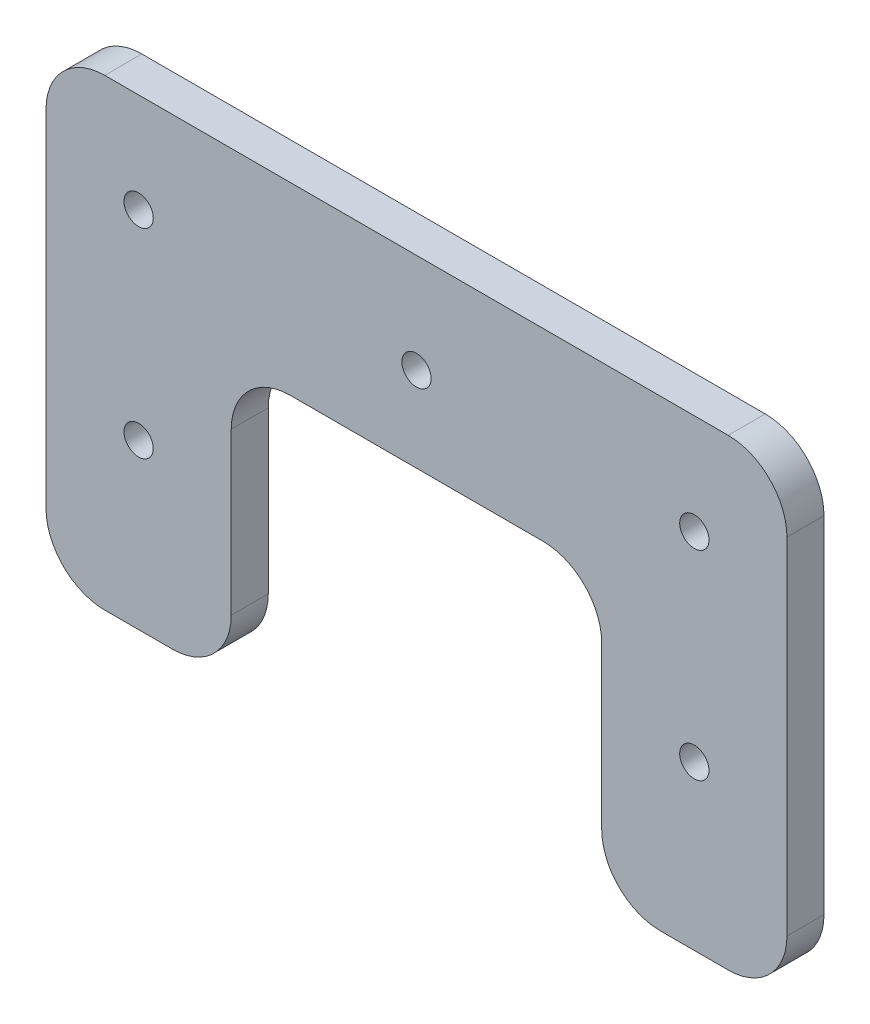
ISO-10303-21;
HEADER;
FILE_DESCRIPTION(('STEP AP214'),'2;1');
FILE_NAME('part.step','',(''),(''),'','','');
FILE_SCHEMA(('AUTOMOTIVE_DESIGN { 1 0 10303 214 1 1 1 1 }'));
ENDSEC;
DATA;
#1=APPLICATION_CONTEXT('core data for automotive mechanical design processes');
#2=APPLICATION_PROTOCOL_DEFINITION('international standard','automotive_design',2000,#1);
#3=PRODUCT_CONTEXT('',#1,'mechanical');
#4=PRODUCT('Part','Part','',(#3));
#5=PRODUCT_RELATED_PRODUCT_CATEGORY('part','',(#4));
#6=PRODUCT_DEFINITION_FORMATION('','',#4);
#7=PRODUCT_DEFINITION_CONTEXT('part definition',#1,'design');
#8=PRODUCT_DEFINITION('design','',#6,#7);
#9=PRODUCT_DEFINITION_SHAPE('','',#8);
#10=(LENGTH_UNIT() NAMED_UNIT(*) SI_UNIT(.MILLI.,.METRE.));
#11=(NAMED_UNIT(*) PLANE_ANGLE_UNIT() SI_UNIT($,.RADIAN.));
#12=(NAMED_UNIT(*) SI_UNIT($,.STERADIAN.) SOLID_ANGLE_UNIT());
#13=UNCERTAINTY_MEASURE_WITH_UNIT(LENGTH_MEASURE(1.E-05),#10,'distance_accuracy_value','');
#14=(GEOMETRIC_REPRESENTATION_CONTEXT(3) GLOBAL_UNCERTAINTY_ASSIGNED_CONTEXT((#13)) GLOBAL_UNIT_ASSIGNED_CONTEXT((#10,
#11,#12)) REPRESENTATION_CONTEXT('',''));
#15=CARTESIAN_POINT('',(0.,0.,0.));
#16=DIRECTION('',(0.,0.,1.));
#17=DIRECTION('',(1.,0.,0.));
#18=AXIS2_PLACEMENT_3D('',#15,#16,#17);
#19=CARTESIAN_POINT('',(6.53805092256941,-17.0456436758322,4.));
#20=DIRECTION('',(0.,0.,-1.));
#21=DIRECTION('',(-1.,0.,0.));
#22=AXIS2_PLACEMENT_3D('',#19,#20,#21);
#23=PLANE('',#22);
#24=DIRECTION('',(0.,-1.,0.));
#25=VECTOR('',#24,1.);
#26=CARTESIAN_POINT('',(0.188050922569408,6.60435632416776,4.));
#27=LINE('',#26,#25);
#28=CARTESIAN_POINT('',(0.188050922569407,20.2543563241677,4.));
#29=VERTEX_POINT('',#28);
#30=CARTESIAN_POINT('',(0.188050922569412,-17.0456436758322,4.));
#31=VERTEX_POINT('',#30);
#32=EDGE_CURVE('E58',#29,#31,#27,.T.);
#33=ORIENTED_EDGE('',*,*,#32,.T.);
#34=CARTESIAN_POINT('',(6.53805092256941,-17.0456436758322,4.));
#35=DIRECTION('',(0.,0.,1.));
#36=DIRECTION('',(-1.,0.,0.));
#37=AXIS2_PLACEMENT_3D('',#34,#35,#36);
#38=CIRCLE('',#37,6.35);
#39=CARTESIAN_POINT('',(6.53805092256945,-23.3956436758322,4.));
#40=VERTEX_POINT('',#39);
#41=EDGE_CURVE('E126',#31,#40,#38,.T.);
#42=ORIENTED_EDGE('',*,*,#41,.T.);
#43=DIRECTION('',(1.,0.,0.));
#44=VECTOR('',#43,1.);
#45=CARTESIAN_POINT('',(6.53805092256945,-23.3956436758322,4.));
#46=LINE('',#45,#44);
#47=CARTESIAN_POINT('',(13.8380509225694,-23.3956436758322,4.));
#48=VERTEX_POINT('',#47);
#49=EDGE_CURVE('E259',#40,#48,#46,.T.);
#50=ORIENTED_EDGE('',*,*,#49,.T.);
#51=CARTESIAN_POINT('',(13.8380509225694,-17.0456436758322,4.));
#52=DIRECTION('',(0.,0.,1.));
#53=DIRECTION('',(1.,0.,0.));
#54=AXIS2_PLACEMENT_3D('',#51,#52,#53);
#55=CIRCLE('',#54,6.35);
#56=CARTESIAN_POINT('',(20.1880509225694,-17.0456436758322,4.));
#57=VERTEX_POINT('',#56);
#58=EDGE_CURVE('E279',#48,#57,#55,.T.);
#59=ORIENTED_EDGE('',*,*,#58,.T.);
#60=DIRECTION('',(0.,1.,0.));
#61=VECTOR('',#60,1.);
#62=CARTESIAN_POINT('',(20.1880509225694,0.349416953919576,4.));
#63=LINE('',#62,#61);
#64=CARTESIAN_POINT('',(20.1880509225694,0.349416953919579,4.));
#65=VERTEX_POINT('',#64);
#66=EDGE_CURVE('E276',#57,#65,#63,.T.);
#67=ORIENTED_EDGE('',*,*,#66,.T.);
#68=CARTESIAN_POINT('',(26.5380509225694,0.349416953919623,4.));
#69=DIRECTION('',(0.,0.,-1.));
#70=DIRECTION('',(1.,0.,0.));
#71=AXIS2_PLACEMENT_3D('',#68,#69,#70);
#72=CIRCLE('',#71,6.35);
#73=CARTESIAN_POINT('',(26.5380509225695,6.69941695391962,4.));
#74=VERTEX_POINT('',#73);
#75=EDGE_CURVE('E278',#65,#74,#72,.T.);
#76=ORIENTED_EDGE('',*,*,#75,.T.);
#77=DIRECTION('',(1.,0.,0.));
#78=VECTOR('',#77,1.);
#79=CARTESIAN_POINT('',(26.5380509225695,6.69941695391962,4.));
#80=LINE('',#79,#78);
#81=CARTESIAN_POINT('',(53.8380509225694,6.69941695391962,4.));
#82=VERTEX_POINT('',#81);
#83=EDGE_CURVE('E281',#74,#82,#80,.T.);
#84=ORIENTED_EDGE('',*,*,#83,.T.);
#85=CARTESIAN_POINT('',(53.8380509225694,0.349416953919623,4.));
#86=DIRECTION('',(0.,0.,-1.));
#87=DIRECTION('',(1.,0.,0.));
#88=AXIS2_PLACEMENT_3D('',#85,#86,#87);
#89=CIRCLE('',#88,6.35);
#90=CARTESIAN_POINT('',(60.1880509225694,0.349416953919577,4.));
#91=VERTEX_POINT('',#90);
#92=EDGE_CURVE('E287',#82,#91,#89,.T.);
#93=ORIENTED_EDGE('',*,*,#92,.T.);
#94=DIRECTION('',(0.,-1.,0.));
#95=VECTOR('',#94,1.);
#96=CARTESIAN_POINT('',(60.1880509225694,0.349416953919577,4.));
#97=LINE('',#96,#95);
#98=CARTESIAN_POINT('',(60.1880509225694,-17.0456436758322,4.));
#99=VERTEX_POINT('',#98);
#100=EDGE_CURVE('E289',#91,#99,#97,.T.);
#101=ORIENTED_EDGE('',*,*,#100,.T.);
#102=CARTESIAN_POINT('',(66.5380509225694,-17.0456436758322,4.));
#103=DIRECTION('',(0.,0.,1.));
#104=DIRECTION('',(-1.,0.,0.));
#105=AXIS2_PLACEMENT_3D('',#102,#103,#104);
#106=CIRCLE('',#105,6.35);
#107=CARTESIAN_POINT('',(66.5380509225695,-23.3956436758322,4.));
#108=VERTEX_POINT('',#107);
#109=EDGE_CURVE('E291',#99,#108,#106,.T.);
#110=ORIENTED_EDGE('',*,*,#109,.T.);
#111=DIRECTION('',(1.,0.,0.));
#112=VECTOR('',#111,1.);
#113=CARTESIAN_POINT('',(73.8380509225694,-23.3956436758322,4.));
#114=LINE('',#113,#112);
#115=CARTESIAN_POINT('',(73.8380509225694,-23.3956436758322,4.));
#116=VERTEX_POINT('',#115);
#117=EDGE_CURVE('E293',#108,#116,#114,.T.);
#118=ORIENTED_EDGE('',*,*,#117,.T.);
#119=CARTESIAN_POINT('',(73.8380509225694,-17.0456436758322,4.));
#120=DIRECTION('',(0.,0.,1.));
#121=DIRECTION('',(1.,0.,0.));
#122=AXIS2_PLACEMENT_3D('',#119,#120,#121);
#123=CIRCLE('',#122,6.35);
#124=CARTESIAN_POINT('',(80.1880509225694,-17.0456436758322,4.));
#125=VERTEX_POINT('',#124);
#126=EDGE_CURVE('E295',#116,#125,#123,.T.);
#127=ORIENTED_EDGE('',*,*,#126,.T.);
#128=DIRECTION('',(0.,1.,0.));
#129=VECTOR('',#128,1.);
#130=CARTESIAN_POINT('',(80.1880509225694,6.60435632416776,4.));
#131=LINE('',#130,#129);
#132=CARTESIAN_POINT('',(80.1880509225694,20.2543563241677,4.));
#133=VERTEX_POINT('',#132);
#134=EDGE_CURVE('E170',#125,#133,#131,.T.);
#135=ORIENTED_EDGE('',*,*,#134,.T.);
#136=CARTESIAN_POINT('',(73.8380509225694,20.2543563241678,4.));
#137=DIRECTION('',(0.,0.,1.));
#138=DIRECTION('',(1.,0.,0.));
#139=AXIS2_PLACEMENT_3D('',#136,#137,#138);
#140=CIRCLE('',#139,6.35);
#141=CARTESIAN_POINT('',(73.8380509225694,26.6043563241678,4.));
#142=VERTEX_POINT('',#141);
#143=EDGE_CURVE('E164',#133,#142,#140,.T.);
#144=ORIENTED_EDGE('',*,*,#143,.T.);
#145=DIRECTION('',(-1.,0.,0.));
#146=VECTOR('',#145,1.);
#147=CARTESIAN_POINT('',(6.53805092256945,26.6043563241678,4.));
#148=LINE('',#147,#146);
#149=CARTESIAN_POINT('',(6.53805092256945,26.6043563241678,4.));
#150=VERTEX_POINT('',#149);
#151=EDGE_CURVE('E168',#142,#150,#148,.T.);
#152=ORIENTED_EDGE('',*,*,#151,.T.);
#153=CARTESIAN_POINT('',(6.53805092256941,20.2543563241678,4.));
#154=DIRECTION('',(0.,0.,1.));
#155=DIRECTION('',(1.,0.,0.));
#156=AXIS2_PLACEMENT_3D('',#153,#154,#155);
#157=CIRCLE('',#156,6.35);
#158=EDGE_CURVE('E184',#150,#29,#157,.T.);
#159=ORIENTED_EDGE('',*,*,#158,.T.);
#160=EDGE_LOOP('',(#33,#42,#50,#59,#67,#76,#84,#93,#101,#110,#118,#127,#135,#144,#152,#159));
#161=FACE_BOUND('',#160,.T.);
#162=CARTESIAN_POINT('',(10.1880509225694,15.8664983327679,4.));
#163=DIRECTION('',(0.,0.,1.));
#164=DIRECTION('',(1.,0.,0.));
#165=AXIS2_PLACEMENT_3D('',#162,#163,#164);
#166=CIRCLE('',#165,1.58);
#167=CARTESIAN_POINT('',(11.7680509225694,15.8664983327679,4.));
#168=VERTEX_POINT('',#167);
#169=EDGE_CURVE('E193',#168,#168,#166,.T.);
#170=ORIENTED_EDGE('',*,*,#169,.F.);
#171=EDGE_LOOP('',(#170));
#172=FACE_BOUND('',#171,.T.);
#173=CARTESIAN_POINT('',(70.1880509225694,15.771437703016,4.));
#174=DIRECTION('',(0.,0.,1.));
#175=DIRECTION('',(1.,0.,0.));
#176=AXIS2_PLACEMENT_3D('',#173,#174,#175);
#177=CIRCLE('',#176,1.58);
#178=CARTESIAN_POINT('',(71.7680509225694,15.771437703016,4.));
#179=VERTEX_POINT('',#178);
#180=EDGE_CURVE('E313',#179,#179,#177,.T.);
#181=ORIENTED_EDGE('',*,*,#180,.F.);
#182=EDGE_LOOP('',(#181));
#183=FACE_BOUND('',#182,.T.);
#184=CARTESIAN_POINT('',(40.1880509225694,15.8664983327679,4.));
#185=DIRECTION('',(0.,0.,1.));
#186=DIRECTION('',(1.,0.,0.));
#187=AXIS2_PLACEMENT_3D('',#184,#185,#186);
#188=CIRCLE('',#187,1.58);
#189=CARTESIAN_POINT('',(41.7680509225694,15.8664983327679,4.));
#190=VERTEX_POINT('',#189);
#191=EDGE_CURVE('E319',#190,#190,#188,.T.);
#192=ORIENTED_EDGE('',*,*,#191,.F.);
#193=EDGE_LOOP('',(#192));
#194=FACE_BOUND('',#193,.T.);
#195=CARTESIAN_POINT('',(10.1880509225694,-5.67649766635961,4.));
#196=DIRECTION('',(0.,0.,1.));
#197=DIRECTION('',(1.,0.,0.));
#198=AXIS2_PLACEMENT_3D('',#195,#196,#197);
#199=CIRCLE('',#198,1.58);
#200=CARTESIAN_POINT('',(11.7680509225694,-5.67649766635961,4.));
#201=VERTEX_POINT('',#200);
#202=EDGE_CURVE('E325',#201,#201,#199,.T.);
#203=ORIENTED_EDGE('',*,*,#202,.F.);
#204=EDGE_LOOP('',(#203));
#205=FACE_BOUND('',#204,.T.);
#206=CARTESIAN_POINT('',(70.1880509225694,-5.77155829611144,4.));
#207=DIRECTION('',(0.,0.,1.));
#208=DIRECTION('',(1.,0.,0.));
#209=AXIS2_PLACEMENT_3D('',#206,#207,#208);
#210=CIRCLE('',#209,1.58);
#211=CARTESIAN_POINT('',(71.7680509225694,-5.77155829611144,4.));
#212=VERTEX_POINT('',#211);
#213=EDGE_CURVE('E331',#212,#212,#210,.T.);
#214=ORIENTED_EDGE('',*,*,#213,.F.);
#215=EDGE_LOOP('',(#214));
#216=FACE_BOUND('',#215,.T.);
#217=ADVANCED_FACE('F41',(#161,#172,#183,#194,#205,#216),#23,.F.);
#218=CARTESIAN_POINT('',(6.53805092256941,-17.0456436758322,0.));
#219=DIRECTION('',(0.,0.,-1.));
#220=DIRECTION('',(-1.,0.,0.));
#221=AXIS2_PLACEMENT_3D('',#218,#219,#220);
#222=PLANE('',#221);
#223=CARTESIAN_POINT('',(10.1880509225694,-5.67649766635961,0.));
#224=DIRECTION('',(0.,0.,1.));
#225=DIRECTION('',(1.,0.,0.));
#226=AXIS2_PLACEMENT_3D('',#223,#224,#225);
#227=CIRCLE('',#226,1.58);
#228=CARTESIAN_POINT('',(11.7680509225694,-5.67649766635961,0.));
#229=VERTEX_POINT('',#228);
#230=EDGE_CURVE('E328',#229,#229,#227,.T.);
#231=ORIENTED_EDGE('',*,*,#230,.T.);
#232=EDGE_LOOP('',(#231));
#233=FACE_BOUND('',#232,.T.);
#234=CARTESIAN_POINT('',(70.1880509225694,15.771437703016,0.));
#235=DIRECTION('',(0.,0.,1.));
#236=DIRECTION('',(1.,0.,0.));
#237=AXIS2_PLACEMENT_3D('',#234,#235,#236);
#238=CIRCLE('',#237,1.58);
#239=CARTESIAN_POINT('',(71.7680509225694,15.771437703016,0.));
#240=VERTEX_POINT('',#239);
#241=EDGE_CURVE('E316',#240,#240,#238,.T.);
#242=ORIENTED_EDGE('',*,*,#241,.T.);
#243=EDGE_LOOP('',(#242));
#244=FACE_BOUND('',#243,.T.);
#245=CARTESIAN_POINT('',(6.53805092256941,-17.0456436758322,0.));
#246=DIRECTION('',(0.,0.,1.));
#247=DIRECTION('',(-1.,0.,0.));
#248=AXIS2_PLACEMENT_3D('',#245,#246,#247);
#249=CIRCLE('',#248,6.35);
#250=CARTESIAN_POINT('',(0.188050922569412,-17.0456436758322,0.));
#251=VERTEX_POINT('',#250);
#252=CARTESIAN_POINT('',(6.53805092256945,-23.3956436758322,0.));
#253=VERTEX_POINT('',#252);
#254=EDGE_CURVE('E190',#251,#253,#249,.T.);
#255=ORIENTED_EDGE('',*,*,#254,.F.);
#256=DIRECTION('',(0.,-1.,0.));
#257=VECTOR('',#256,1.);
#258=CARTESIAN_POINT('',(0.188050922569408,6.60435632416776,0.));
#259=LINE('',#258,#257);
#260=CARTESIAN_POINT('',(0.188050922569407,20.2543563241677,0.));
#261=VERTEX_POINT('',#260);
#262=EDGE_CURVE('E219',#261,#251,#259,.T.);
#263=ORIENTED_EDGE('',*,*,#262,.F.);
#264=CARTESIAN_POINT('',(6.53805092256941,20.2543563241678,0.));
#265=DIRECTION('',(0.,0.,1.));
#266=DIRECTION('',(1.,0.,0.));
#267=AXIS2_PLACEMENT_3D('',#264,#265,#266);
#268=CIRCLE('',#267,6.35);
#269=CARTESIAN_POINT('',(6.53805092256945,26.6043563241678,0.));
#270=VERTEX_POINT('',#269);
#271=EDGE_CURVE('E119',#270,#261,#268,.T.);
#272=ORIENTED_EDGE('',*,*,#271,.F.);
#273=DIRECTION('',(-1.,0.,0.));
#274=VECTOR('',#273,1.);
#275=CARTESIAN_POINT('',(6.53805092256945,26.6043563241678,0.));
#276=LINE('',#275,#274);
#277=CARTESIAN_POINT('',(73.8380509225694,26.6043563241678,0.));
#278=VERTEX_POINT('',#277);
#279=EDGE_CURVE('E112',#278,#270,#276,.T.);
#280=ORIENTED_EDGE('',*,*,#279,.F.);
#281=CARTESIAN_POINT('',(73.8380509225694,20.2543563241678,0.));
#282=DIRECTION('',(0.,0.,1.));
#283=DIRECTION('',(1.,0.,0.));
#284=AXIS2_PLACEMENT_3D('',#281,#282,#283);
#285=CIRCLE('',#284,6.35);
#286=CARTESIAN_POINT('',(80.1880509225694,20.2543563241677,0.));
#287=VERTEX_POINT('',#286);
#288=EDGE_CURVE('E178',#287,#278,#285,.T.);
#289=ORIENTED_EDGE('',*,*,#288,.F.);
#290=DIRECTION('',(0.,1.,0.));
#291=VECTOR('',#290,1.);
#292=CARTESIAN_POINT('',(80.1880509225694,6.60435632416776,0.));
#293=LINE('',#292,#291);
#294=CARTESIAN_POINT('',(80.1880509225694,-17.0456436758322,0.));
#295=VERTEX_POINT('',#294);
#296=EDGE_CURVE('E214',#295,#287,#293,.T.);
#297=ORIENTED_EDGE('',*,*,#296,.F.);
#298=CARTESIAN_POINT('',(73.8380509225694,-17.0456436758322,0.));
#299=DIRECTION('',(0.,0.,1.));
#300=DIRECTION('',(1.,0.,0.));
#301=AXIS2_PLACEMENT_3D('',#298,#299,#300);
#302=CIRCLE('',#301,6.35);
#303=CARTESIAN_POINT('',(73.8380509225694,-23.3956436758322,0.));
#304=VERTEX_POINT('',#303);
#305=EDGE_CURVE('E211',#304,#295,#302,.T.);
#306=ORIENTED_EDGE('',*,*,#305,.F.);
#307=DIRECTION('',(1.,0.,0.));
#308=VECTOR('',#307,1.);
#309=CARTESIAN_POINT('',(73.8380509225694,-23.3956436758322,0.));
#310=LINE('',#309,#308);
#311=CARTESIAN_POINT('',(66.5380509225695,-23.3956436758322,0.));
#312=VERTEX_POINT('',#311);
#313=EDGE_CURVE('E209',#312,#304,#310,.T.);
#314=ORIENTED_EDGE('',*,*,#313,.F.);
#315=CARTESIAN_POINT('',(66.5380509225694,-17.0456436758322,0.));
#316=DIRECTION('',(0.,0.,1.));
#317=DIRECTION('',(-1.,0.,0.));
#318=AXIS2_PLACEMENT_3D('',#315,#316,#317);
#319=CIRCLE('',#318,6.35);
#320=CARTESIAN_POINT('',(60.1880509225694,-17.0456436758322,0.));
#321=VERTEX_POINT('',#320);
#322=EDGE_CURVE('E207',#321,#312,#319,.T.);
#323=ORIENTED_EDGE('',*,*,#322,.F.);
#324=DIRECTION('',(0.,-1.,0.));
#325=VECTOR('',#324,1.);
#326=CARTESIAN_POINT('',(60.1880509225694,0.349416953919577,0.));
#327=LINE('',#326,#325);
#328=CARTESIAN_POINT('',(60.1880509225694,0.349416953919577,0.));
#329=VERTEX_POINT('',#328);
#330=EDGE_CURVE('E205',#329,#321,#327,.T.);
#331=ORIENTED_EDGE('',*,*,#330,.F.);
#332=CARTESIAN_POINT('',(53.8380509225694,0.349416953919623,0.));
#333=DIRECTION('',(0.,0.,-1.));
#334=DIRECTION('',(1.,0.,0.));
#335=AXIS2_PLACEMENT_3D('',#332,#333,#334);
#336=CIRCLE('',#335,6.35);
#337=CARTESIAN_POINT('',(53.8380509225694,6.69941695391962,0.));
#338=VERTEX_POINT('',#337);
#339=EDGE_CURVE('E203',#338,#329,#336,.T.);
#340=ORIENTED_EDGE('',*,*,#339,.F.);
#341=DIRECTION('',(1.,0.,0.));
#342=VECTOR('',#341,1.);
#343=CARTESIAN_POINT('',(26.5380509225695,6.69941695391962,0.));
#344=LINE('',#343,#342);
#345=CARTESIAN_POINT('',(26.5380509225695,6.69941695391962,0.));
#346=VERTEX_POINT('',#345);
#347=EDGE_CURVE('E201',#346,#338,#344,.T.);
#348=ORIENTED_EDGE('',*,*,#347,.F.);
#349=CARTESIAN_POINT('',(26.5380509225694,0.349416953919623,0.));
#350=DIRECTION('',(0.,0.,-1.));
#351=DIRECTION('',(1.,0.,0.));
#352=AXIS2_PLACEMENT_3D('',#349,#350,#351);
#353=CIRCLE('',#352,6.35);
#354=CARTESIAN_POINT('',(20.1880509225694,0.349416953919579,0.));
#355=VERTEX_POINT('',#354);
#356=EDGE_CURVE('E199',#355,#346,#353,.T.);
#357=ORIENTED_EDGE('',*,*,#356,.F.);
#358=DIRECTION('',(0.,1.,0.));
#359=VECTOR('',#358,1.);
#360=CARTESIAN_POINT('',(20.1880509225694,0.349416953919576,0.));
#361=LINE('',#360,#359);
#362=CARTESIAN_POINT('',(20.1880509225694,-17.0456436758322,0.));
#363=VERTEX_POINT('',#362);
#364=EDGE_CURVE('E197',#363,#355,#361,.T.);
#365=ORIENTED_EDGE('',*,*,#364,.F.);
#366=CARTESIAN_POINT('',(13.8380509225694,-17.0456436758322,0.));
#367=DIRECTION('',(0.,0.,1.));
#368=DIRECTION('',(1.,0.,0.));
#369=AXIS2_PLACEMENT_3D('',#366,#367,#368);
#370=CIRCLE('',#369,6.35);
#371=CARTESIAN_POINT('',(13.8380509225694,-23.3956436758322,0.));
#372=VERTEX_POINT('',#371);
#373=EDGE_CURVE('E195',#372,#363,#370,.T.);
#374=ORIENTED_EDGE('',*,*,#373,.F.);
#375=DIRECTION('',(1.,0.,0.));
#376=VECTOR('',#375,1.);
#377=CARTESIAN_POINT('',(6.53805092256945,-23.3956436758322,0.));
#378=LINE('',#377,#376);
#379=EDGE_CURVE('E192',#253,#372,#378,.T.);
#380=ORIENTED_EDGE('',*,*,#379,.F.);
#381=EDGE_LOOP('',(#255,#263,#272,#280,#289,#297,#306,#314,#323,#331,#340,#348,#357,#365,#374,#380));
#382=FACE_BOUND('',#381,.T.);
#383=CARTESIAN_POINT('',(10.1880509225694,15.8664983327679,0.));
#384=DIRECTION('',(0.,0.,1.));
#385=DIRECTION('',(1.,0.,0.));
#386=AXIS2_PLACEMENT_3D('',#383,#384,#385);
#387=CIRCLE('',#386,1.58);
#388=CARTESIAN_POINT('',(11.7680509225694,15.8664983327679,0.));
#389=VERTEX_POINT('',#388);
#390=EDGE_CURVE('E310',#389,#389,#387,.T.);
#391=ORIENTED_EDGE('',*,*,#390,.T.);
#392=EDGE_LOOP('',(#391));
#393=FACE_BOUND('',#392,.T.);
#394=CARTESIAN_POINT('',(40.1880509225694,15.8664983327679,0.));
#395=DIRECTION('',(0.,0.,1.));
#396=DIRECTION('',(1.,0.,0.));
#397=AXIS2_PLACEMENT_3D('',#394,#395,#396);
#398=CIRCLE('',#397,1.58);
#399=CARTESIAN_POINT('',(41.7680509225694,15.8664983327679,0.));
#400=VERTEX_POINT('',#399);
#401=EDGE_CURVE('E322',#400,#400,#398,.T.);
#402=ORIENTED_EDGE('',*,*,#401,.T.);
#403=EDGE_LOOP('',(#402));
#404=FACE_BOUND('',#403,.T.);
#405=CARTESIAN_POINT('',(70.1880509225694,-5.77155829611144,0.));
#406=DIRECTION('',(0.,0.,1.));
#407=DIRECTION('',(1.,0.,0.));
#408=AXIS2_PLACEMENT_3D('',#405,#406,#407);
#409=CIRCLE('',#408,1.58);
#410=CARTESIAN_POINT('',(71.7680509225694,-5.77155829611144,0.));
#411=VERTEX_POINT('',#410);
#412=EDGE_CURVE('E334',#411,#411,#409,.T.);
#413=ORIENTED_EDGE('',*,*,#412,.T.);
#414=EDGE_LOOP('',(#413));
#415=FACE_BOUND('',#414,.T.);
#416=ADVANCED_FACE('F263',(#233,#244,#382,#393,#404,#415),#222,.T.);
#417=CARTESIAN_POINT('',(6.53805092256941,-17.0456436758322,4.));
#418=DIRECTION('',(0.,0.,-1.));
#419=DIRECTION('',(-1.,0.,0.));
#420=AXIS2_PLACEMENT_3D('',#417,#418,#419);
#421=CYLINDRICAL_SURFACE('',#420,6.35);
#422=ORIENTED_EDGE('',*,*,#254,.T.);
#423=DIRECTION('',(0.,0.,-1.));
#424=VECTOR('',#423,1.);
#425=CARTESIAN_POINT('',(6.53805092256945,-23.3956436758322,4.));
#426=LINE('',#425,#424);
#427=EDGE_CURVE('E50',#40,#253,#426,.T.);
#428=ORIENTED_EDGE('',*,*,#427,.F.);
#429=ORIENTED_EDGE('',*,*,#41,.F.);
#430=DIRECTION('',(0.,0.,-1.));
#431=VECTOR('',#430,1.);
#432=CARTESIAN_POINT('',(0.188050922569412,-17.0456436758322,4.));
#433=LINE('',#432,#431);
#434=EDGE_CURVE('E11',#31,#251,#433,.T.);
#435=ORIENTED_EDGE('',*,*,#434,.T.);
#436=EDGE_LOOP('',(#422,#428,#429,#435));
#437=FACE_BOUND('',#436,.T.);
#438=ADVANCED_FACE('F43',(#437),#421,.T.);
#439=CARTESIAN_POINT('',(6.53805092256945,-23.3956436758322,4.));
#440=DIRECTION('',(0.,1.,0.));
#441=DIRECTION('',(-1.,0.,0.));
#442=AXIS2_PLACEMENT_3D('',#439,#440,#441);
#443=PLANE('',#442);
#444=ORIENTED_EDGE('',*,*,#379,.T.);
#445=DIRECTION('',(0.,0.,-1.));
#446=VECTOR('',#445,1.);
#447=CARTESIAN_POINT('',(13.8380509225694,-23.3956436758322,4.));
#448=LINE('',#447,#446);
#449=EDGE_CURVE('E251',#48,#372,#448,.T.);
#450=ORIENTED_EDGE('',*,*,#449,.F.);
#451=ORIENTED_EDGE('',*,*,#49,.F.);
#452=ORIENTED_EDGE('',*,*,#427,.T.);
#453=EDGE_LOOP('',(#444,#450,#451,#452));
#454=FACE_BOUND('',#453,.T.);
#455=ADVANCED_FACE('F257',(#454),#443,.F.);
#456=CARTESIAN_POINT('',(13.8380509225694,-17.0456436758322,4.));
#457=DIRECTION('',(0.,0.,-1.));
#458=DIRECTION('',(-1.,0.,0.));
#459=AXIS2_PLACEMENT_3D('',#456,#457,#458);
#460=CYLINDRICAL_SURFACE('',#459,6.35);
#461=ORIENTED_EDGE('',*,*,#373,.T.);
#462=DIRECTION('',(0.,0.,-1.));
#463=VECTOR('',#462,1.);
#464=CARTESIAN_POINT('',(20.1880509225694,-17.0456436758322,4.));
#465=LINE('',#464,#463);
#466=EDGE_CURVE('E248',#57,#363,#465,.T.);
#467=ORIENTED_EDGE('',*,*,#466,.F.);
#468=ORIENTED_EDGE('',*,*,#58,.F.);
#469=ORIENTED_EDGE('',*,*,#449,.T.);
#470=EDGE_LOOP('',(#461,#467,#468,#469));
#471=FACE_BOUND('',#470,.T.);
#472=ADVANCED_FACE('F270',(#471),#460,.T.);
#473=CARTESIAN_POINT('',(20.1880509225694,0.349416953919576,4.));
#474=DIRECTION('',(-1.,0.,0.));
#475=DIRECTION('',(0.,-1.,0.));
#476=AXIS2_PLACEMENT_3D('',#473,#474,#475);
#477=PLANE('',#476);
#478=ORIENTED_EDGE('',*,*,#364,.T.);
#479=DIRECTION('',(0.,0.,-1.));
#480=VECTOR('',#479,1.);
#481=CARTESIAN_POINT('',(20.1880509225694,0.349416953919579,4.));
#482=LINE('',#481,#480);
#483=EDGE_CURVE('E245',#65,#355,#482,.T.);
#484=ORIENTED_EDGE('',*,*,#483,.F.);
#485=ORIENTED_EDGE('',*,*,#66,.F.);
#486=ORIENTED_EDGE('',*,*,#466,.T.);
#487=EDGE_LOOP('',(#478,#484,#485,#486));
#488=FACE_BOUND('',#487,.T.);
#489=ADVANCED_FACE('F274',(#488),#477,.F.);
#490=CARTESIAN_POINT('',(26.5380509225694,0.349416953919623,4.));
#491=DIRECTION('',(0.,0.,-1.));
#492=DIRECTION('',(-1.,0.,0.));
#493=AXIS2_PLACEMENT_3D('',#490,#491,#492);
#494=CYLINDRICAL_SURFACE('',#493,6.35);
#495=ORIENTED_EDGE('',*,*,#356,.T.);
#496=DIRECTION('',(0.,0.,-1.));
#497=VECTOR('',#496,1.);
#498=CARTESIAN_POINT('',(26.5380509225695,6.69941695391962,4.));
#499=LINE('',#498,#497);
#500=EDGE_CURVE('E242',#74,#346,#499,.T.);
#501=ORIENTED_EDGE('',*,*,#500,.F.);
#502=ORIENTED_EDGE('',*,*,#75,.F.);
#503=ORIENTED_EDGE('',*,*,#483,.T.);
#504=EDGE_LOOP('',(#495,#501,#502,#503));
#505=FACE_BOUND('',#504,.T.);
#506=ADVANCED_FACE('F385',(#505),#494,.F.);
#507=CARTESIAN_POINT('',(26.5380509225695,6.69941695391962,4.));
#508=DIRECTION('',(0.,1.,0.));
#509=DIRECTION('',(0.,0.,1.));
#510=AXIS2_PLACEMENT_3D('',#507,#508,#509);
#511=PLANE('',#510);
#512=ORIENTED_EDGE('',*,*,#347,.T.);
#513=DIRECTION('',(0.,0.,-1.));
#514=VECTOR('',#513,1.);
#515=CARTESIAN_POINT('',(53.8380509225694,6.69941695391962,4.));
#516=LINE('',#515,#514);
#517=EDGE_CURVE('E239',#82,#338,#516,.T.);
#518=ORIENTED_EDGE('',*,*,#517,.F.);
#519=ORIENTED_EDGE('',*,*,#83,.F.);
#520=ORIENTED_EDGE('',*,*,#500,.T.);
#521=EDGE_LOOP('',(#512,#518,#519,#520));
#522=FACE_BOUND('',#521,.T.);
#523=ADVANCED_FACE('F381',(#522),#511,.F.);
#524=CARTESIAN_POINT('',(53.8380509225694,0.349416953919623,4.));
#525=DIRECTION('',(0.,0.,-1.));
#526=DIRECTION('',(-1.,0.,0.));
#527=AXIS2_PLACEMENT_3D('',#524,#525,#526);
#528=CYLINDRICAL_SURFACE('',#527,6.35);
#529=ORIENTED_EDGE('',*,*,#339,.T.);
#530=DIRECTION('',(0.,0.,-1.));
#531=VECTOR('',#530,1.);
#532=CARTESIAN_POINT('',(60.1880509225694,0.349416953919577,4.));
#533=LINE('',#532,#531);
#534=EDGE_CURVE('E236',#91,#329,#533,.T.);
#535=ORIENTED_EDGE('',*,*,#534,.F.);
#536=ORIENTED_EDGE('',*,*,#92,.F.);
#537=ORIENTED_EDGE('',*,*,#517,.T.);
#538=EDGE_LOOP('',(#529,#535,#536,#537));
#539=FACE_BOUND('',#538,.T.);
#540=ADVANCED_FACE('F377',(#539),#528,.F.);
#541=CARTESIAN_POINT('',(60.1880509225694,0.349416953919577,4.));
#542=DIRECTION('',(1.,0.,0.));
#543=DIRECTION('',(0.,0.,-1.));
#544=AXIS2_PLACEMENT_3D('',#541,#542,#543);
#545=PLANE('',#544);
#546=ORIENTED_EDGE('',*,*,#330,.T.);
#547=DIRECTION('',(0.,0.,-1.));
#548=VECTOR('',#547,1.);
#549=CARTESIAN_POINT('',(60.1880509225694,-17.0456436758322,4.));
#550=LINE('',#549,#548);
#551=EDGE_CURVE('E233',#99,#321,#550,.T.);
#552=ORIENTED_EDGE('',*,*,#551,.F.);
#553=ORIENTED_EDGE('',*,*,#100,.F.);
#554=ORIENTED_EDGE('',*,*,#534,.T.);
#555=EDGE_LOOP('',(#546,#552,#553,#554));
#556=FACE_BOUND('',#555,.T.);
#557=ADVANCED_FACE('F373',(#556),#545,.F.);
#558=CARTESIAN_POINT('',(66.5380509225694,-17.0456436758322,4.));
#559=DIRECTION('',(0.,0.,-1.));
#560=DIRECTION('',(-1.,0.,0.));
#561=AXIS2_PLACEMENT_3D('',#558,#559,#560);
#562=CYLINDRICAL_SURFACE('',#561,6.35);
#563=ORIENTED_EDGE('',*,*,#322,.T.);
#564=DIRECTION('',(0.,0.,-1.));
#565=VECTOR('',#564,1.);
#566=CARTESIAN_POINT('',(66.5380509225695,-23.3956436758322,4.));
#567=LINE('',#566,#565);
#568=EDGE_CURVE('E230',#108,#312,#567,.T.);
#569=ORIENTED_EDGE('',*,*,#568,.F.);
#570=ORIENTED_EDGE('',*,*,#109,.F.);
#571=ORIENTED_EDGE('',*,*,#551,.T.);
#572=EDGE_LOOP('',(#563,#569,#570,#571));
#573=FACE_BOUND('',#572,.T.);
#574=ADVANCED_FACE('F369',(#573),#562,.T.);
#575=CARTESIAN_POINT('',(73.8380509225694,-23.3956436758322,4.));
#576=DIRECTION('',(0.,1.,0.));
#577=DIRECTION('',(0.,0.,1.));
#578=AXIS2_PLACEMENT_3D('',#575,#576,#577);
#579=PLANE('',#578);
#580=ORIENTED_EDGE('',*,*,#313,.T.);
#581=DIRECTION('',(0.,0.,-1.));
#582=VECTOR('',#581,1.);
#583=CARTESIAN_POINT('',(73.8380509225694,-23.3956436758322,4.));
#584=LINE('',#583,#582);
#585=EDGE_CURVE('E227',#116,#304,#584,.T.);
#586=ORIENTED_EDGE('',*,*,#585,.F.);
#587=ORIENTED_EDGE('',*,*,#117,.F.);
#588=ORIENTED_EDGE('',*,*,#568,.T.);
#589=EDGE_LOOP('',(#580,#586,#587,#588));
#590=FACE_BOUND('',#589,.T.);
#591=ADVANCED_FACE('F366',(#590),#579,.F.);
#592=CARTESIAN_POINT('',(73.8380509225694,-17.0456436758322,4.));
#593=DIRECTION('',(0.,0.,-1.));
#594=DIRECTION('',(-1.,0.,0.));
#595=AXIS2_PLACEMENT_3D('',#592,#593,#594);
#596=CYLINDRICAL_SURFACE('',#595,6.35);
#597=ORIENTED_EDGE('',*,*,#305,.T.);
#598=DIRECTION('',(0.,0.,-1.));
#599=VECTOR('',#598,1.);
#600=CARTESIAN_POINT('',(80.1880509225694,-17.0456436758322,4.));
#601=LINE('',#600,#599);
#602=EDGE_CURVE('E224',#125,#295,#601,.T.);
#603=ORIENTED_EDGE('',*,*,#602,.F.);
#604=ORIENTED_EDGE('',*,*,#126,.F.);
#605=ORIENTED_EDGE('',*,*,#585,.T.);
#606=EDGE_LOOP('',(#597,#603,#604,#605));
#607=FACE_BOUND('',#606,.T.);
#608=ADVANCED_FACE('F301',(#607),#596,.T.);
#609=CARTESIAN_POINT('',(80.1880509225694,6.60435632416776,4.));
#610=DIRECTION('',(-1.,0.,0.));
#611=DIRECTION('',(0.,0.,1.));
#612=AXIS2_PLACEMENT_3D('',#609,#610,#611);
#613=PLANE('',#612);
#614=ORIENTED_EDGE('',*,*,#296,.T.);
#615=DIRECTION('',(0.,0.,-1.));
#616=VECTOR('',#615,1.);
#617=CARTESIAN_POINT('',(80.1880509225694,20.2543563241677,4.));
#618=LINE('',#617,#616);
#619=EDGE_CURVE('E179',#133,#287,#618,.T.);
#620=ORIENTED_EDGE('',*,*,#619,.F.);
#621=ORIENTED_EDGE('',*,*,#134,.F.);
#622=ORIENTED_EDGE('',*,*,#602,.T.);
#623=EDGE_LOOP('',(#614,#620,#621,#622));
#624=FACE_BOUND('',#623,.T.);
#625=ADVANCED_FACE('F304',(#624),#613,.F.);
#626=CARTESIAN_POINT('',(73.8380509225694,20.2543563241678,4.));
#627=DIRECTION('',(0.,0.,-1.));
#628=DIRECTION('',(-1.,0.,0.));
#629=AXIS2_PLACEMENT_3D('',#626,#627,#628);
#630=CYLINDRICAL_SURFACE('',#629,6.35);
#631=ORIENTED_EDGE('',*,*,#288,.T.);
#632=DIRECTION('',(0.,0.,-1.));
#633=VECTOR('',#632,1.);
#634=CARTESIAN_POINT('',(73.8380509225694,26.6043563241678,4.));
#635=LINE('',#634,#633);
#636=EDGE_CURVE('E175',#142,#278,#635,.T.);
#637=ORIENTED_EDGE('',*,*,#636,.F.);
#638=ORIENTED_EDGE('',*,*,#143,.F.);
#639=ORIENTED_EDGE('',*,*,#619,.T.);
#640=EDGE_LOOP('',(#631,#637,#638,#639));
#641=FACE_BOUND('',#640,.T.);
#642=ADVANCED_FACE('F176',(#641),#630,.T.);
#643=CARTESIAN_POINT('',(6.53805092256945,26.6043563241678,4.));
#644=DIRECTION('',(0.,-1.,0.));
#645=DIRECTION('',(0.,0.,-1.));
#646=AXIS2_PLACEMENT_3D('',#643,#644,#645);
#647=PLANE('',#646);
#648=ORIENTED_EDGE('',*,*,#279,.T.);
#649=DIRECTION('',(0.,0.,-1.));
#650=VECTOR('',#649,1.);
#651=CARTESIAN_POINT('',(6.53805092256945,26.6043563241678,4.));
#652=LINE('',#651,#650);
#653=EDGE_CURVE('E180',#150,#270,#652,.T.);
#654=ORIENTED_EDGE('',*,*,#653,.F.);
#655=ORIENTED_EDGE('',*,*,#151,.F.);
#656=ORIENTED_EDGE('',*,*,#636,.T.);
#657=EDGE_LOOP('',(#648,#654,#655,#656));
#658=FACE_BOUND('',#657,.T.);
#659=ADVANCED_FACE('F182',(#658),#647,.F.);
#660=CARTESIAN_POINT('',(6.53805092256941,20.2543563241678,4.));
#661=DIRECTION('',(0.,0.,-1.));
#662=DIRECTION('',(-1.,0.,0.));
#663=AXIS2_PLACEMENT_3D('',#660,#661,#662);
#664=CYLINDRICAL_SURFACE('',#663,6.35);
#665=ORIENTED_EDGE('',*,*,#271,.T.);
#666=DIRECTION('',(0.,0.,-1.));
#667=VECTOR('',#666,1.);
#668=CARTESIAN_POINT('',(0.188050922569407,20.2543563241677,4.));
#669=LINE('',#668,#667);
#670=EDGE_CURVE('E186',#29,#261,#669,.T.);
#671=ORIENTED_EDGE('',*,*,#670,.F.);
#672=ORIENTED_EDGE('',*,*,#158,.F.);
#673=ORIENTED_EDGE('',*,*,#653,.T.);
#674=EDGE_LOOP('',(#665,#671,#672,#673));
#675=FACE_BOUND('',#674,.T.);
#676=ADVANCED_FACE('F306',(#675),#664,.T.);
#677=CARTESIAN_POINT('',(0.188050922569408,6.60435632416776,4.));
#678=DIRECTION('',(1.,0.,0.));
#679=DIRECTION('',(0.,1.,0.));
#680=AXIS2_PLACEMENT_3D('',#677,#678,#679);
#681=PLANE('',#680);
#682=ORIENTED_EDGE('',*,*,#262,.T.);
#683=ORIENTED_EDGE('',*,*,#434,.F.);
#684=ORIENTED_EDGE('',*,*,#32,.F.);
#685=ORIENTED_EDGE('',*,*,#670,.T.);
#686=EDGE_LOOP('',(#682,#683,#684,#685));
#687=FACE_BOUND('',#686,.T.);
#688=ADVANCED_FACE('F305',(#687),#681,.F.);
#689=CARTESIAN_POINT('',(10.1880509225694,15.8664983327679,4.));
#690=DIRECTION('',(0.,0.,-1.));
#691=DIRECTION('',(-1.,0.,0.));
#692=AXIS2_PLACEMENT_3D('',#689,#690,#691);
#693=CYLINDRICAL_SURFACE('',#692,1.58);
#694=ORIENTED_EDGE('',*,*,#169,.T.);
#695=EDGE_LOOP('',(#694));
#696=FACE_BOUND('',#695,.T.);
#697=ORIENTED_EDGE('',*,*,#390,.F.);
#698=EDGE_LOOP('',(#697));
#699=FACE_BOUND('',#698,.T.);
#700=ADVANCED_FACE('F351',(#696,#699),#693,.F.);
#701=CARTESIAN_POINT('',(70.1880509225694,15.771437703016,4.));
#702=DIRECTION('',(0.,0.,-1.));
#703=DIRECTION('',(-1.,0.,0.));
#704=AXIS2_PLACEMENT_3D('',#701,#702,#703);
#705=CYLINDRICAL_SURFACE('',#704,1.58);
#706=ORIENTED_EDGE('',*,*,#180,.T.);
#707=EDGE_LOOP('',(#706));
#708=FACE_BOUND('',#707,.T.);
#709=ORIENTED_EDGE('',*,*,#241,.F.);
#710=EDGE_LOOP('',(#709));
#711=FACE_BOUND('',#710,.T.);
#712=ADVANCED_FACE('F494',(#708,#711),#705,.F.);
#713=CARTESIAN_POINT('',(40.1880509225694,15.8664983327679,4.));
#714=DIRECTION('',(0.,0.,-1.));
#715=DIRECTION('',(-1.,0.,0.));
#716=AXIS2_PLACEMENT_3D('',#713,#714,#715);
#717=CYLINDRICAL_SURFACE('',#716,1.58);
#718=ORIENTED_EDGE('',*,*,#191,.T.);
#719=EDGE_LOOP('',(#718));
#720=FACE_BOUND('',#719,.T.);
#721=ORIENTED_EDGE('',*,*,#401,.F.);
#722=EDGE_LOOP('',(#721));
#723=FACE_BOUND('',#722,.T.);
#724=ADVANCED_FACE('F502',(#720,#723),#717,.F.);
#725=CARTESIAN_POINT('',(10.1880509225694,-5.67649766635961,4.));
#726=DIRECTION('',(0.,0.,-1.));
#727=DIRECTION('',(-1.,0.,0.));
#728=AXIS2_PLACEMENT_3D('',#725,#726,#727);
#729=CYLINDRICAL_SURFACE('',#728,1.58);
#730=ORIENTED_EDGE('',*,*,#202,.T.);
#731=EDGE_LOOP('',(#730));
#732=FACE_BOUND('',#731,.T.);
#733=ORIENTED_EDGE('',*,*,#230,.F.);
#734=EDGE_LOOP('',(#733));
#735=FACE_BOUND('',#734,.T.);
#736=ADVANCED_FACE('F510',(#732,#735),#729,.F.);
#737=CARTESIAN_POINT('',(70.1880509225694,-5.77155829611144,4.));
#738=DIRECTION('',(0.,0.,-1.));
#739=DIRECTION('',(-1.,0.,0.));
#740=AXIS2_PLACEMENT_3D('',#737,#738,#739);
#741=CYLINDRICAL_SURFACE('',#740,1.58);
#742=ORIENTED_EDGE('',*,*,#213,.T.);
#743=EDGE_LOOP('',(#742));
#744=FACE_BOUND('',#743,.T.);
#745=ORIENTED_EDGE('',*,*,#412,.F.);
#746=EDGE_LOOP('',(#745));
#747=FACE_BOUND('',#746,.T.);
#748=ADVANCED_FACE('F340',(#744,#747),#741,.F.);
#749=CLOSED_SHELL('',(#217,#416,#438,#455,#472,#489,#506,#523,#540,#557,#574,#591,#608,#625,
#642,#659,#676,#688,#700,#712,#724,#736,#748));
#750=MANIFOLD_SOLID_BREP('B2',#749);
#751=ADVANCED_BREP_SHAPE_REPRESENTATION('',(#18,#750),#14);
#752=SHAPE_DEFINITION_REPRESENTATION(#9,#751);
ENDSEC;
END-ISO-10303-21;
